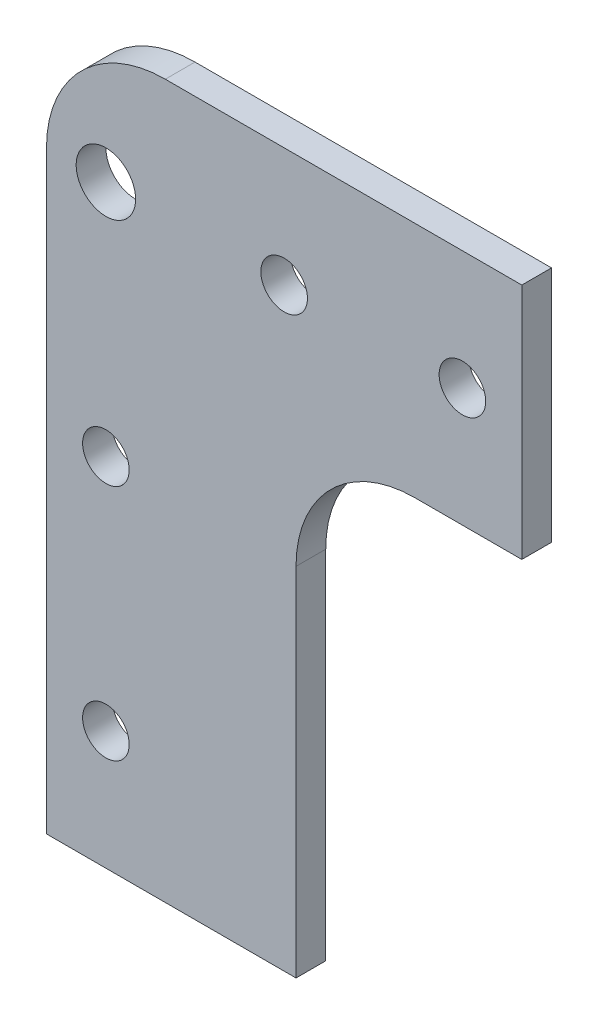
ISO-10303-21;
HEADER;
FILE_DESCRIPTION(('STEP AP214'),'2;1');
FILE_NAME('part.step','',(''),(''),'','','');
FILE_SCHEMA(('AUTOMOTIVE_DESIGN { 1 0 10303 214 1 1 1 1 }'));
ENDSEC;
DATA;
#1=APPLICATION_CONTEXT('core data for automotive mechanical design processes');
#2=APPLICATION_PROTOCOL_DEFINITION('international standard','automotive_design',2000,#1);
#3=PRODUCT_CONTEXT('',#1,'mechanical');
#4=PRODUCT('Part','Part','',(#3));
#5=PRODUCT_RELATED_PRODUCT_CATEGORY('part','',(#4));
#6=PRODUCT_DEFINITION_FORMATION('','',#4);
#7=PRODUCT_DEFINITION_CONTEXT('part definition',#1,'design');
#8=PRODUCT_DEFINITION('design','',#6,#7);
#9=PRODUCT_DEFINITION_SHAPE('','',#8);
#10=(LENGTH_UNIT() NAMED_UNIT(*) SI_UNIT(.MILLI.,.METRE.));
#11=(NAMED_UNIT(*) PLANE_ANGLE_UNIT() SI_UNIT($,.RADIAN.));
#12=(NAMED_UNIT(*) SI_UNIT($,.STERADIAN.) SOLID_ANGLE_UNIT());
#13=UNCERTAINTY_MEASURE_WITH_UNIT(LENGTH_MEASURE(1.E-05),#10,'distance_accuracy_value','');
#14=(GEOMETRIC_REPRESENTATION_CONTEXT(3) GLOBAL_UNCERTAINTY_ASSIGNED_CONTEXT((#13)) GLOBAL_UNIT_ASSIGNED_CONTEXT((#10,
#11,#12)) REPRESENTATION_CONTEXT('',''));
#15=CARTESIAN_POINT('',(0.,0.,0.));
#16=DIRECTION('',(0.,0.,1.));
#17=DIRECTION('',(1.,0.,0.));
#18=AXIS2_PLACEMENT_3D('',#15,#16,#17);
#19=CARTESIAN_POINT('',(0.,0.,3.175));
#20=DIRECTION('',(0.,0.,-1.));
#21=DIRECTION('',(-1.,0.,0.));
#22=AXIS2_PLACEMENT_3D('',#19,#20,#21);
#23=PLANE('',#22);
#24=DIRECTION('',(-1.,0.,0.));
#25=VECTOR('',#24,1.);
#26=CARTESIAN_POINT('',(0.,0.,3.175));
#27=LINE('',#26,#25);
#28=CARTESIAN_POINT('',(50.8,0.,3.175));
#29=VERTEX_POINT('',#28);
#30=CARTESIAN_POINT('',(12.7,0.,3.175));
#31=VERTEX_POINT('',#30);
#32=EDGE_CURVE('E159',#29,#31,#27,.T.);
#33=ORIENTED_EDGE('',*,*,#32,.T.);
#34=CARTESIAN_POINT('',(12.7,-12.7,3.175));
#35=DIRECTION('',(0.,0.,-1.));
#36=DIRECTION('',(-1.,0.,0.));
#37=AXIS2_PLACEMENT_3D('',#34,#35,#36);
#38=CIRCLE('',#37,12.7);
#39=CARTESIAN_POINT('',(0.,-12.7,3.175));
#40=VERTEX_POINT('',#39);
#41=EDGE_CURVE('E104',#31,#40,#38,.F.);
#42=ORIENTED_EDGE('',*,*,#41,.T.);
#43=DIRECTION('',(0.,-1.,0.));
#44=VECTOR('',#43,1.);
#45=CARTESIAN_POINT('',(0.,-76.2,3.175));
#46=LINE('',#45,#44);
#47=CARTESIAN_POINT('',(0.,-76.2,3.175));
#48=VERTEX_POINT('',#47);
#49=EDGE_CURVE('E97',#40,#48,#46,.T.);
#50=ORIENTED_EDGE('',*,*,#49,.T.);
#51=DIRECTION('',(1.,0.,0.));
#52=VECTOR('',#51,1.);
#53=CARTESIAN_POINT('',(26.67,-76.2000000000001,3.175));
#54=LINE('',#53,#52);
#55=CARTESIAN_POINT('',(26.67,-76.2000000000001,3.175));
#56=VERTEX_POINT('',#55);
#57=EDGE_CURVE('E101',#48,#56,#54,.T.);
#58=ORIENTED_EDGE('',*,*,#57,.T.);
#59=DIRECTION('',(0.,1.,0.));
#60=VECTOR('',#59,1.);
#61=CARTESIAN_POINT('',(26.67,-25.4000000000001,3.175));
#62=LINE('',#61,#60);
#63=CARTESIAN_POINT('',(26.67,-38.1000000000001,3.175));
#64=VERTEX_POINT('',#63);
#65=EDGE_CURVE('E117',#56,#64,#62,.T.);
#66=ORIENTED_EDGE('',*,*,#65,.T.);
#67=CARTESIAN_POINT('',(39.37,-38.1000000000001,3.175));
#68=DIRECTION('',(0.,0.,-1.));
#69=DIRECTION('',(-1.,0.,0.));
#70=AXIS2_PLACEMENT_3D('',#67,#68,#69);
#71=CIRCLE('',#70,12.7);
#72=CARTESIAN_POINT('',(39.37,-25.4000000000001,3.175));
#73=VERTEX_POINT('',#72);
#74=EDGE_CURVE('E11',#64,#73,#71,.T.);
#75=ORIENTED_EDGE('',*,*,#74,.T.);
#76=DIRECTION('',(1.,0.,0.));
#77=VECTOR('',#76,1.);
#78=CARTESIAN_POINT('',(50.8,-25.4,3.175));
#79=LINE('',#78,#77);
#80=CARTESIAN_POINT('',(50.8,-25.4,3.175));
#81=VERTEX_POINT('',#80);
#82=EDGE_CURVE('E155',#73,#81,#79,.T.);
#83=ORIENTED_EDGE('',*,*,#82,.T.);
#84=DIRECTION('',(0.,1.,0.));
#85=VECTOR('',#84,1.);
#86=CARTESIAN_POINT('',(50.8,0.,3.175));
#87=LINE('',#86,#85);
#88=EDGE_CURVE('E157',#81,#29,#87,.T.);
#89=ORIENTED_EDGE('',*,*,#88,.T.);
#90=EDGE_LOOP('',(#33,#42,#50,#58,#66,#75,#83,#89));
#91=FACE_BOUND('',#90,.T.);
#92=CARTESIAN_POINT('',(44.45,-12.7,3.175));
#93=DIRECTION('',(0.,0.,1.));
#94=DIRECTION('',(1.,0.,0.));
#95=AXIS2_PLACEMENT_3D('',#92,#93,#94);
#96=CIRCLE('',#95,2.4892);
#97=CARTESIAN_POINT('',(46.9392,-12.7,3.175));
#98=VERTEX_POINT('',#97);
#99=EDGE_CURVE('E166',#98,#98,#96,.T.);
#100=ORIENTED_EDGE('',*,*,#99,.F.);
#101=EDGE_LOOP('',(#100));
#102=FACE_BOUND('',#101,.T.);
#103=CARTESIAN_POINT('',(25.4,-12.7,3.175));
#104=DIRECTION('',(0.,0.,1.));
#105=DIRECTION('',(1.,0.,0.));
#106=AXIS2_PLACEMENT_3D('',#103,#104,#105);
#107=CIRCLE('',#106,2.4892);
#108=CARTESIAN_POINT('',(27.8892,-12.7,3.175));
#109=VERTEX_POINT('',#108);
#110=EDGE_CURVE('E335',#109,#109,#107,.T.);
#111=ORIENTED_EDGE('',*,*,#110,.F.);
#112=EDGE_LOOP('',(#111));
#113=FACE_BOUND('',#112,.T.);
#114=CARTESIAN_POINT('',(6.35,-12.7,3.175));
#115=DIRECTION('',(0.,0.,1.));
#116=DIRECTION('',(1.,0.,0.));
#117=AXIS2_PLACEMENT_3D('',#114,#115,#116);
#118=CIRCLE('',#117,3.17500000000001);
#119=CARTESIAN_POINT('',(9.52500000000001,-12.7,3.175));
#120=VERTEX_POINT('',#119);
#121=EDGE_CURVE('E329',#120,#120,#118,.T.);
#122=ORIENTED_EDGE('',*,*,#121,.F.);
#123=EDGE_LOOP('',(#122));
#124=FACE_BOUND('',#123,.T.);
#125=CARTESIAN_POINT('',(6.35,-38.1,3.175));
#126=DIRECTION('',(0.,0.,1.));
#127=DIRECTION('',(1.,0.,0.));
#128=AXIS2_PLACEMENT_3D('',#125,#126,#127);
#129=CIRCLE('',#128,2.48920000000001);
#130=CARTESIAN_POINT('',(8.83920000000001,-38.1,3.175));
#131=VERTEX_POINT('',#130);
#132=EDGE_CURVE('E316',#131,#131,#129,.T.);
#133=ORIENTED_EDGE('',*,*,#132,.F.);
#134=EDGE_LOOP('',(#133));
#135=FACE_BOUND('',#134,.T.);
#136=CARTESIAN_POINT('',(6.35,-63.5,3.175));
#137=DIRECTION('',(0.,0.,1.));
#138=DIRECTION('',(1.,0.,0.));
#139=AXIS2_PLACEMENT_3D('',#136,#137,#138);
#140=CIRCLE('',#139,2.48919999999999);
#141=CARTESIAN_POINT('',(8.83919999999999,-63.5,3.175));
#142=VERTEX_POINT('',#141);
#143=EDGE_CURVE('E320',#142,#142,#140,.T.);
#144=ORIENTED_EDGE('',*,*,#143,.F.);
#145=EDGE_LOOP('',(#144));
#146=FACE_BOUND('',#145,.T.);
#147=ADVANCED_FACE('F34',(#91,#102,#113,#124,#135,#146),#23,.F.);
#148=CARTESIAN_POINT('',(0.,0.,0.));
#149=DIRECTION('',(0.,0.,-1.));
#150=DIRECTION('',(-1.,0.,0.));
#151=AXIS2_PLACEMENT_3D('',#148,#149,#150);
#152=PLANE('',#151);
#153=CARTESIAN_POINT('',(6.35,-38.1,0.));
#154=DIRECTION('',(0.,0.,1.));
#155=DIRECTION('',(1.,0.,0.));
#156=AXIS2_PLACEMENT_3D('',#153,#154,#155);
#157=CIRCLE('',#156,2.48920000000001);
#158=CARTESIAN_POINT('',(8.83920000000001,-38.1,0.));
#159=VERTEX_POINT('',#158);
#160=EDGE_CURVE('E319',#159,#159,#157,.T.);
#161=ORIENTED_EDGE('',*,*,#160,.T.);
#162=EDGE_LOOP('',(#161));
#163=FACE_BOUND('',#162,.T.);
#164=CARTESIAN_POINT('',(25.4,-12.7,0.));
#165=DIRECTION('',(0.,0.,1.));
#166=DIRECTION('',(1.,0.,0.));
#167=AXIS2_PLACEMENT_3D('',#164,#165,#166);
#168=CIRCLE('',#167,2.4892);
#169=CARTESIAN_POINT('',(27.8892,-12.7,0.));
#170=VERTEX_POINT('',#169);
#171=EDGE_CURVE('E332',#170,#170,#168,.T.);
#172=ORIENTED_EDGE('',*,*,#171,.T.);
#173=EDGE_LOOP('',(#172));
#174=FACE_BOUND('',#173,.T.);
#175=DIRECTION('',(0.,-1.,0.));
#176=VECTOR('',#175,1.);
#177=CARTESIAN_POINT('',(0.,-76.2,0.));
#178=LINE('',#177,#176);
#179=CARTESIAN_POINT('',(0.,-12.7,0.));
#180=VERTEX_POINT('',#179);
#181=CARTESIAN_POINT('',(0.,-76.2,0.));
#182=VERTEX_POINT('',#181);
#183=EDGE_CURVE('E121',#180,#182,#178,.T.);
#184=ORIENTED_EDGE('',*,*,#183,.F.);
#185=CARTESIAN_POINT('',(12.7,-12.7,0.));
#186=DIRECTION('',(0.,0.,-1.));
#187=DIRECTION('',(-1.,0.,0.));
#188=AXIS2_PLACEMENT_3D('',#185,#186,#187);
#189=CIRCLE('',#188,12.7);
#190=CARTESIAN_POINT('',(12.7,0.,0.));
#191=VERTEX_POINT('',#190);
#192=EDGE_CURVE('E125',#180,#191,#189,.T.);
#193=ORIENTED_EDGE('',*,*,#192,.T.);
#194=DIRECTION('',(-1.,0.,0.));
#195=VECTOR('',#194,1.);
#196=CARTESIAN_POINT('',(0.,0.,0.));
#197=LINE('',#196,#195);
#198=CARTESIAN_POINT('',(50.8,0.,0.));
#199=VERTEX_POINT('',#198);
#200=EDGE_CURVE('E109',#199,#191,#197,.T.);
#201=ORIENTED_EDGE('',*,*,#200,.F.);
#202=DIRECTION('',(0.,1.,0.));
#203=VECTOR('',#202,1.);
#204=CARTESIAN_POINT('',(50.8,0.,0.));
#205=LINE('',#204,#203);
#206=CARTESIAN_POINT('',(50.8,-25.4,0.));
#207=VERTEX_POINT('',#206);
#208=EDGE_CURVE('E169',#207,#199,#205,.T.);
#209=ORIENTED_EDGE('',*,*,#208,.F.);
#210=DIRECTION('',(1.,0.,0.));
#211=VECTOR('',#210,1.);
#212=CARTESIAN_POINT('',(50.8,-25.4,0.));
#213=LINE('',#212,#211);
#214=CARTESIAN_POINT('',(39.37,-25.4000000000001,0.));
#215=VERTEX_POINT('',#214);
#216=EDGE_CURVE('E145',#215,#207,#213,.T.);
#217=ORIENTED_EDGE('',*,*,#216,.F.);
#218=CARTESIAN_POINT('',(39.37,-38.1000000000001,0.));
#219=DIRECTION('',(0.,0.,-1.));
#220=DIRECTION('',(-1.,0.,0.));
#221=AXIS2_PLACEMENT_3D('',#218,#219,#220);
#222=CIRCLE('',#221,12.7);
#223=CARTESIAN_POINT('',(26.67,-38.1000000000001,0.));
#224=VERTEX_POINT('',#223);
#225=EDGE_CURVE('E42',#215,#224,#222,.F.);
#226=ORIENTED_EDGE('',*,*,#225,.T.);
#227=DIRECTION('',(0.,1.,0.));
#228=VECTOR('',#227,1.);
#229=CARTESIAN_POINT('',(26.67,-25.4000000000001,0.));
#230=LINE('',#229,#228);
#231=CARTESIAN_POINT('',(26.67,-76.2000000000001,0.));
#232=VERTEX_POINT('',#231);
#233=EDGE_CURVE('E143',#232,#224,#230,.T.);
#234=ORIENTED_EDGE('',*,*,#233,.F.);
#235=DIRECTION('',(1.,0.,0.));
#236=VECTOR('',#235,1.);
#237=CARTESIAN_POINT('',(26.67,-76.2000000000001,0.));
#238=LINE('',#237,#236);
#239=EDGE_CURVE('E149',#182,#232,#238,.T.);
#240=ORIENTED_EDGE('',*,*,#239,.F.);
#241=EDGE_LOOP('',(#184,#193,#201,#209,#217,#226,#234,#240));
#242=FACE_BOUND('',#241,.T.);
#243=CARTESIAN_POINT('',(44.45,-12.7,0.));
#244=DIRECTION('',(0.,0.,1.));
#245=DIRECTION('',(1.,0.,0.));
#246=AXIS2_PLACEMENT_3D('',#243,#244,#245);
#247=CIRCLE('',#246,2.4892);
#248=CARTESIAN_POINT('',(46.9392,-12.7,0.));
#249=VERTEX_POINT('',#248);
#250=EDGE_CURVE('E338',#249,#249,#247,.T.);
#251=ORIENTED_EDGE('',*,*,#250,.T.);
#252=EDGE_LOOP('',(#251));
#253=FACE_BOUND('',#252,.T.);
#254=CARTESIAN_POINT('',(6.35,-12.7,0.));
#255=DIRECTION('',(0.,0.,1.));
#256=DIRECTION('',(1.,0.,0.));
#257=AXIS2_PLACEMENT_3D('',#254,#255,#256);
#258=CIRCLE('',#257,3.17500000000001);
#259=CARTESIAN_POINT('',(9.52500000000001,-12.7,0.));
#260=VERTEX_POINT('',#259);
#261=EDGE_CURVE('E322',#260,#260,#258,.T.);
#262=ORIENTED_EDGE('',*,*,#261,.T.);
#263=EDGE_LOOP('',(#262));
#264=FACE_BOUND('',#263,.T.);
#265=CARTESIAN_POINT('',(6.35,-63.5,0.));
#266=DIRECTION('',(0.,0.,1.));
#267=DIRECTION('',(1.,0.,0.));
#268=AXIS2_PLACEMENT_3D('',#265,#266,#267);
#269=CIRCLE('',#268,2.48919999999999);
#270=CARTESIAN_POINT('',(8.83919999999999,-63.5,0.));
#271=VERTEX_POINT('',#270);
#272=EDGE_CURVE('E325',#271,#271,#269,.T.);
#273=ORIENTED_EDGE('',*,*,#272,.T.);
#274=EDGE_LOOP('',(#273));
#275=FACE_BOUND('',#274,.T.);
#276=ADVANCED_FACE('F141',(#163,#174,#242,#253,#264,#275),#152,.T.);
#277=CARTESIAN_POINT('',(0.,-76.2,3.175));
#278=DIRECTION('',(1.,0.,0.));
#279=DIRECTION('',(0.,0.,-1.));
#280=AXIS2_PLACEMENT_3D('',#277,#278,#279);
#281=PLANE('',#280);
#282=ORIENTED_EDGE('',*,*,#49,.F.);
#283=DIRECTION('',(0.,0.,-1.));
#284=VECTOR('',#283,1.);
#285=CARTESIAN_POINT('',(0.,-12.7,3.175));
#286=LINE('',#285,#284);
#287=EDGE_CURVE('E123',#40,#180,#286,.T.);
#288=ORIENTED_EDGE('',*,*,#287,.T.);
#289=ORIENTED_EDGE('',*,*,#183,.T.);
#290=DIRECTION('',(0.,0.,-1.));
#291=VECTOR('',#290,1.);
#292=CARTESIAN_POINT('',(0.,-76.2,3.175));
#293=LINE('',#292,#291);
#294=EDGE_CURVE('E114',#48,#182,#293,.T.);
#295=ORIENTED_EDGE('',*,*,#294,.F.);
#296=EDGE_LOOP('',(#282,#288,#289,#295));
#297=FACE_BOUND('',#296,.T.);
#298=ADVANCED_FACE('F119',(#297),#281,.F.);
#299=CARTESIAN_POINT('',(26.67,-76.2000000000001,3.175));
#300=DIRECTION('',(0.,1.,0.));
#301=DIRECTION('',(-1.,0.,0.));
#302=AXIS2_PLACEMENT_3D('',#299,#300,#301);
#303=PLANE('',#302);
#304=ORIENTED_EDGE('',*,*,#239,.T.);
#305=DIRECTION('',(0.,0.,-1.));
#306=VECTOR('',#305,1.);
#307=CARTESIAN_POINT('',(26.67,-76.2000000000001,3.175));
#308=LINE('',#307,#306);
#309=EDGE_CURVE('E116',#56,#232,#308,.T.);
#310=ORIENTED_EDGE('',*,*,#309,.F.);
#311=ORIENTED_EDGE('',*,*,#57,.F.);
#312=ORIENTED_EDGE('',*,*,#294,.T.);
#313=EDGE_LOOP('',(#304,#310,#311,#312));
#314=FACE_BOUND('',#313,.T.);
#315=ADVANCED_FACE('F113',(#314),#303,.F.);
#316=CARTESIAN_POINT('',(26.67,-25.4000000000001,3.175));
#317=DIRECTION('',(-1.,0.,0.));
#318=DIRECTION('',(0.,-1.,0.));
#319=AXIS2_PLACEMENT_3D('',#316,#317,#318);
#320=PLANE('',#319);
#321=ORIENTED_EDGE('',*,*,#233,.T.);
#322=DIRECTION('',(0.,0.,-1.));
#323=VECTOR('',#322,1.);
#324=CARTESIAN_POINT('',(26.67,-38.1000000000001,3.175));
#325=LINE('',#324,#323);
#326=EDGE_CURVE('E55',#224,#64,#325,.F.);
#327=ORIENTED_EDGE('',*,*,#326,.T.);
#328=ORIENTED_EDGE('',*,*,#65,.F.);
#329=ORIENTED_EDGE('',*,*,#309,.T.);
#330=EDGE_LOOP('',(#321,#327,#328,#329));
#331=FACE_BOUND('',#330,.T.);
#332=ADVANCED_FACE('F148',(#331),#320,.F.);
#333=CARTESIAN_POINT('',(50.8,-25.4,3.175));
#334=DIRECTION('',(0.,1.,0.));
#335=DIRECTION('',(-1.,0.,0.));
#336=AXIS2_PLACEMENT_3D('',#333,#334,#335);
#337=PLANE('',#336);
#338=ORIENTED_EDGE('',*,*,#82,.F.);
#339=DIRECTION('',(0.,0.,-1.));
#340=VECTOR('',#339,1.);
#341=CARTESIAN_POINT('',(39.37,-25.4000000000001,0.));
#342=LINE('',#341,#340);
#343=EDGE_CURVE('E135',#73,#215,#342,.T.);
#344=ORIENTED_EDGE('',*,*,#343,.T.);
#345=ORIENTED_EDGE('',*,*,#216,.T.);
#346=DIRECTION('',(0.,0.,-1.));
#347=VECTOR('',#346,1.);
#348=CARTESIAN_POINT('',(50.8,-25.4,3.175));
#349=LINE('',#348,#347);
#350=EDGE_CURVE('E127',#81,#207,#349,.T.);
#351=ORIENTED_EDGE('',*,*,#350,.F.);
#352=EDGE_LOOP('',(#338,#344,#345,#351));
#353=FACE_BOUND('',#352,.T.);
#354=ADVANCED_FACE('F152',(#353),#337,.F.);
#355=CARTESIAN_POINT('',(50.8,0.,3.175));
#356=DIRECTION('',(-1.,0.,0.));
#357=DIRECTION('',(0.,-1.,0.));
#358=AXIS2_PLACEMENT_3D('',#355,#356,#357);
#359=PLANE('',#358);
#360=ORIENTED_EDGE('',*,*,#208,.T.);
#361=DIRECTION('',(0.,0.,-1.));
#362=VECTOR('',#361,1.);
#363=CARTESIAN_POINT('',(50.8,0.,3.175));
#364=LINE('',#363,#362);
#365=EDGE_CURVE('E164',#29,#199,#364,.T.);
#366=ORIENTED_EDGE('',*,*,#365,.F.);
#367=ORIENTED_EDGE('',*,*,#88,.F.);
#368=ORIENTED_EDGE('',*,*,#350,.T.);
#369=EDGE_LOOP('',(#360,#366,#367,#368));
#370=FACE_BOUND('',#369,.T.);
#371=ADVANCED_FACE('F175',(#370),#359,.F.);
#372=CARTESIAN_POINT('',(0.,0.,3.175));
#373=DIRECTION('',(0.,-1.,0.));
#374=DIRECTION('',(0.,0.,-1.));
#375=AXIS2_PLACEMENT_3D('',#372,#373,#374);
#376=PLANE('',#375);
#377=ORIENTED_EDGE('',*,*,#200,.T.);
#378=DIRECTION('',(0.,0.,-1.));
#379=VECTOR('',#378,1.);
#380=CARTESIAN_POINT('',(12.7,0.,3.175));
#381=LINE('',#380,#379);
#382=EDGE_CURVE('E132',#191,#31,#381,.F.);
#383=ORIENTED_EDGE('',*,*,#382,.T.);
#384=ORIENTED_EDGE('',*,*,#32,.F.);
#385=ORIENTED_EDGE('',*,*,#365,.T.);
#386=EDGE_LOOP('',(#377,#383,#384,#385));
#387=FACE_BOUND('',#386,.T.);
#388=ADVANCED_FACE('F180',(#387),#376,.F.);
#389=CARTESIAN_POINT('',(44.45,-12.7,3.175));
#390=DIRECTION('',(0.,0.,-1.));
#391=DIRECTION('',(-1.,0.,0.));
#392=AXIS2_PLACEMENT_3D('',#389,#390,#391);
#393=CYLINDRICAL_SURFACE('',#392,2.4892);
#394=ORIENTED_EDGE('',*,*,#99,.T.);
#395=EDGE_LOOP('',(#394));
#396=FACE_BOUND('',#395,.T.);
#397=ORIENTED_EDGE('',*,*,#250,.F.);
#398=EDGE_LOOP('',(#397));
#399=FACE_BOUND('',#398,.T.);
#400=ADVANCED_FACE('F202',(#396,#399),#393,.F.);
#401=CARTESIAN_POINT('',(25.4,-12.7,3.175));
#402=DIRECTION('',(0.,0.,-1.));
#403=DIRECTION('',(-1.,0.,0.));
#404=AXIS2_PLACEMENT_3D('',#401,#402,#403);
#405=CYLINDRICAL_SURFACE('',#404,2.4892);
#406=ORIENTED_EDGE('',*,*,#110,.T.);
#407=EDGE_LOOP('',(#406));
#408=FACE_BOUND('',#407,.T.);
#409=ORIENTED_EDGE('',*,*,#171,.F.);
#410=EDGE_LOOP('',(#409));
#411=FACE_BOUND('',#410,.T.);
#412=ADVANCED_FACE('F245',(#408,#411),#405,.F.);
#413=CARTESIAN_POINT('',(6.35,-12.7,3.175));
#414=DIRECTION('',(0.,0.,-1.));
#415=DIRECTION('',(-1.,0.,0.));
#416=AXIS2_PLACEMENT_3D('',#413,#414,#415);
#417=CYLINDRICAL_SURFACE('',#416,3.17500000000001);
#418=ORIENTED_EDGE('',*,*,#121,.T.);
#419=EDGE_LOOP('',(#418));
#420=FACE_BOUND('',#419,.T.);
#421=ORIENTED_EDGE('',*,*,#261,.F.);
#422=EDGE_LOOP('',(#421));
#423=FACE_BOUND('',#422,.T.);
#424=ADVANCED_FACE('F252',(#420,#423),#417,.F.);
#425=CARTESIAN_POINT('',(6.35,-38.1,3.175));
#426=DIRECTION('',(0.,0.,-1.));
#427=DIRECTION('',(-1.,0.,0.));
#428=AXIS2_PLACEMENT_3D('',#425,#426,#427);
#429=CYLINDRICAL_SURFACE('',#428,2.48920000000001);
#430=ORIENTED_EDGE('',*,*,#132,.T.);
#431=EDGE_LOOP('',(#430));
#432=FACE_BOUND('',#431,.T.);
#433=ORIENTED_EDGE('',*,*,#160,.F.);
#434=EDGE_LOOP('',(#433));
#435=FACE_BOUND('',#434,.T.);
#436=ADVANCED_FACE('F190',(#432,#435),#429,.F.);
#437=CARTESIAN_POINT('',(6.35,-63.5,3.175));
#438=DIRECTION('',(0.,0.,-1.));
#439=DIRECTION('',(-1.,0.,0.));
#440=AXIS2_PLACEMENT_3D('',#437,#438,#439);
#441=CYLINDRICAL_SURFACE('',#440,2.48919999999999);
#442=ORIENTED_EDGE('',*,*,#143,.T.);
#443=EDGE_LOOP('',(#442));
#444=FACE_BOUND('',#443,.T.);
#445=ORIENTED_EDGE('',*,*,#272,.F.);
#446=EDGE_LOOP('',(#445));
#447=FACE_BOUND('',#446,.T.);
#448=ADVANCED_FACE('F185',(#444,#447),#441,.F.);
#449=CARTESIAN_POINT('',(12.7,-12.7,3.175));
#450=DIRECTION('',(0.,0.,-1.));
#451=DIRECTION('',(-1.,0.,0.));
#452=AXIS2_PLACEMENT_3D('',#449,#450,#451);
#453=CYLINDRICAL_SURFACE('',#452,12.7);
#454=ORIENTED_EDGE('',*,*,#41,.F.);
#455=ORIENTED_EDGE('',*,*,#382,.F.);
#456=ORIENTED_EDGE('',*,*,#192,.F.);
#457=ORIENTED_EDGE('',*,*,#287,.F.);
#458=EDGE_LOOP('',(#454,#455,#456,#457));
#459=FACE_BOUND('',#458,.T.);
#460=ADVANCED_FACE('F183',(#459),#453,.T.);
#461=CARTESIAN_POINT('',(39.37,-38.1000000000001,3.175));
#462=DIRECTION('',(0.,0.,1.));
#463=DIRECTION('',(1.,0.,0.));
#464=AXIS2_PLACEMENT_3D('',#461,#462,#463);
#465=CYLINDRICAL_SURFACE('',#464,12.7);
#466=ORIENTED_EDGE('',*,*,#74,.F.);
#467=ORIENTED_EDGE('',*,*,#326,.F.);
#468=ORIENTED_EDGE('',*,*,#225,.F.);
#469=ORIENTED_EDGE('',*,*,#343,.F.);
#470=EDGE_LOOP('',(#466,#467,#468,#469));
#471=FACE_BOUND('',#470,.T.);
#472=ADVANCED_FACE('F36',(#471),#465,.F.);
#473=CLOSED_SHELL('',(#147,#276,#298,#315,#332,#354,#371,#388,#400,#412,#424,#436,#448,#460,#472));
#474=MANIFOLD_SOLID_BREP('B2',#473);
#475=ADVANCED_BREP_SHAPE_REPRESENTATION('',(#18,#474),#14);
#476=SHAPE_DEFINITION_REPRESENTATION(#9,#475);
ENDSEC;
END-ISO-10303-21;
